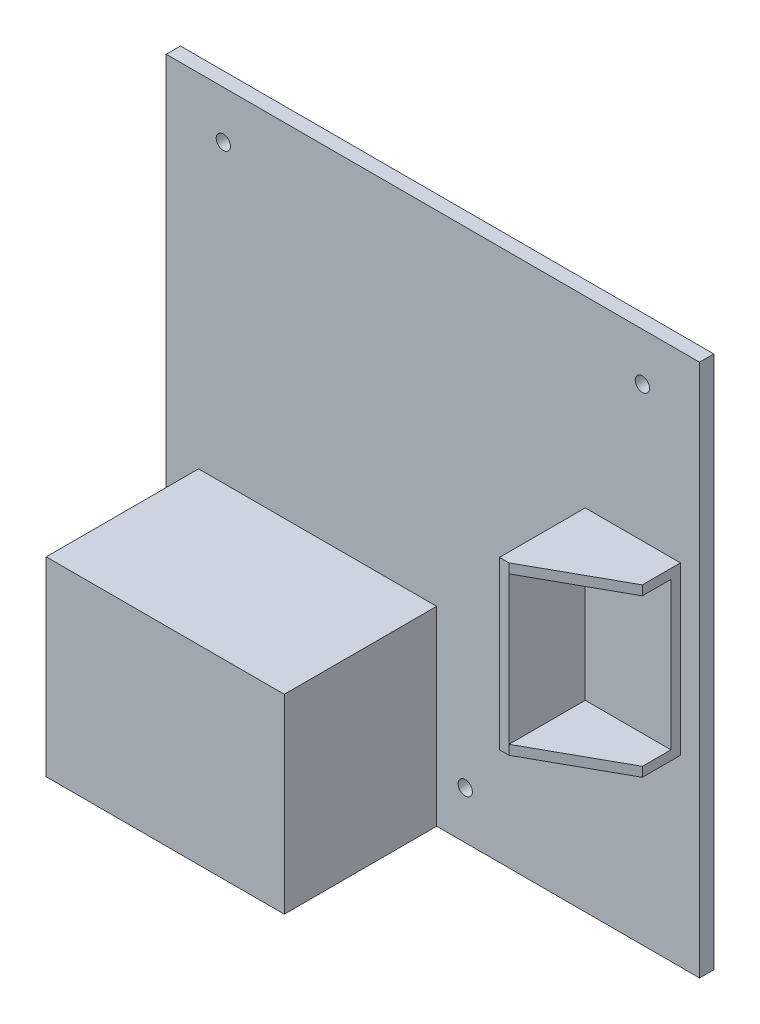
ISO-10303-21;
HEADER;
FILE_DESCRIPTION(('STEP AP214'),'2;1');
FILE_NAME('part.step','',(''),(''),'','','');
FILE_SCHEMA(('AUTOMOTIVE_DESIGN { 1 0 10303 214 1 1 1 1 }'));
ENDSEC;
DATA;
#1=APPLICATION_CONTEXT('core data for automotive mechanical design processes');
#2=APPLICATION_PROTOCOL_DEFINITION('international standard','automotive_design',2000,#1);
#3=PRODUCT_CONTEXT('',#1,'mechanical');
#4=PRODUCT('Part','Part','',(#3));
#5=PRODUCT_RELATED_PRODUCT_CATEGORY('part','',(#4));
#6=PRODUCT_DEFINITION_FORMATION('','',#4);
#7=PRODUCT_DEFINITION_CONTEXT('part definition',#1,'design');
#8=PRODUCT_DEFINITION('design','',#6,#7);
#9=PRODUCT_DEFINITION_SHAPE('','',#8);
#10=(LENGTH_UNIT() NAMED_UNIT(*) SI_UNIT(.MILLI.,.METRE.));
#11=(NAMED_UNIT(*) PLANE_ANGLE_UNIT() SI_UNIT($,.RADIAN.));
#12=(NAMED_UNIT(*) SI_UNIT($,.STERADIAN.) SOLID_ANGLE_UNIT());
#13=UNCERTAINTY_MEASURE_WITH_UNIT(LENGTH_MEASURE(1.E-05),#10,'distance_accuracy_value','');
#14=(GEOMETRIC_REPRESENTATION_CONTEXT(3) GLOBAL_UNCERTAINTY_ASSIGNED_CONTEXT((#13)) GLOBAL_UNIT_ASSIGNED_CONTEXT((#10,
#11,#12)) REPRESENTATION_CONTEXT('',''));
#15=CARTESIAN_POINT('',(0.,0.,0.));
#16=DIRECTION('',(0.,0.,1.));
#17=DIRECTION('',(1.,0.,0.));
#18=AXIS2_PLACEMENT_3D('',#15,#16,#17);
#19=CARTESIAN_POINT('',(0.,0.,3.));
#20=DIRECTION('',(0.,0.,-1.));
#21=DIRECTION('',(-1.,0.,0.));
#22=AXIS2_PLACEMENT_3D('',#19,#20,#21);
#23=PLANE('',#22);
#24=DIRECTION('',(0.,-1.,0.));
#25=VECTOR('',#24,1.);
#26=CARTESIAN_POINT('',(-49.1967650273224,-56.,3.));
#27=LINE('',#26,#25);
#28=CARTESIAN_POINT('',(-49.1967650273224,-16.,3.));
#29=VERTEX_POINT('',#28);
#30=CARTESIAN_POINT('',(-49.1967650273224,-56.,3.));
#31=VERTEX_POINT('',#30);
#32=EDGE_CURVE('E184',#29,#31,#27,.T.);
#33=ORIENTED_EDGE('',*,*,#32,.F.);
#34=DIRECTION('',(-1.,0.,0.));
#35=VECTOR('',#34,1.);
#36=CARTESIAN_POINT('',(-49.1967650273224,-16.,3.));
#37=LINE('',#36,#35);
#38=CARTESIAN_POINT('',(0.803234972677577,-16.,3.));
#39=VERTEX_POINT('',#38);
#40=EDGE_CURVE('E200',#39,#29,#37,.T.);
#41=ORIENTED_EDGE('',*,*,#40,.F.);
#42=DIRECTION('',(0.,1.,0.));
#43=VECTOR('',#42,1.);
#44=CARTESIAN_POINT('',(0.803234972677577,-56.,3.));
#45=LINE('',#44,#43);
#46=CARTESIAN_POINT('',(0.803234972677577,-56.,3.));
#47=VERTEX_POINT('',#46);
#48=EDGE_CURVE('E209',#47,#39,#45,.T.);
#49=ORIENTED_EDGE('',*,*,#48,.F.);
#50=DIRECTION('',(1.,0.,0.));
#51=VECTOR('',#50,1.);
#52=CARTESIAN_POINT('',(-56.,-56.,3.));
#53=LINE('',#52,#51);
#54=CARTESIAN_POINT('',(56.,-56.,3.));
#55=VERTEX_POINT('',#54);
#56=EDGE_CURVE('E234',#47,#55,#53,.T.);
#57=ORIENTED_EDGE('',*,*,#56,.T.);
#58=DIRECTION('',(0.,1.,0.));
#59=VECTOR('',#58,1.);
#60=CARTESIAN_POINT('',(56.,-56.,3.));
#61=LINE('',#60,#59);
#62=CARTESIAN_POINT('',(56.,56.,3.));
#63=VERTEX_POINT('',#62);
#64=EDGE_CURVE('E226',#55,#63,#61,.T.);
#65=ORIENTED_EDGE('',*,*,#64,.T.);
#66=DIRECTION('',(-1.,0.,0.));
#67=VECTOR('',#66,1.);
#68=CARTESIAN_POINT('',(-56.,56.,3.));
#69=LINE('',#68,#67);
#70=CARTESIAN_POINT('',(-56.,56.,3.));
#71=VERTEX_POINT('',#70);
#72=EDGE_CURVE('E229',#63,#71,#69,.T.);
#73=ORIENTED_EDGE('',*,*,#72,.T.);
#74=DIRECTION('',(0.,-1.,0.));
#75=VECTOR('',#74,1.);
#76=CARTESIAN_POINT('',(-56.,-56.,3.));
#77=LINE('',#76,#75);
#78=CARTESIAN_POINT('',(-56.,-56.,3.));
#79=VERTEX_POINT('',#78);
#80=EDGE_CURVE('E232',#71,#79,#77,.T.);
#81=ORIENTED_EDGE('',*,*,#80,.T.);
#82=EDGE_CURVE('E235',#79,#31,#53,.T.);
#83=ORIENTED_EDGE('',*,*,#82,.T.);
#84=EDGE_LOOP('',(#33,#41,#49,#57,#65,#73,#81,#83));
#85=FACE_BOUND('',#84,.T.);
#86=CARTESIAN_POINT('',(6.80323497267758,-46.,3.));
#87=DIRECTION('',(0.,0.,1.));
#88=DIRECTION('',(1.,0.,0.));
#89=AXIS2_PLACEMENT_3D('',#86,#87,#88);
#90=CIRCLE('',#89,1.5);
#91=CARTESIAN_POINT('',(8.30323497267758,-46.,3.));
#92=VERTEX_POINT('',#91);
#93=EDGE_CURVE('E174',#92,#92,#90,.T.);
#94=ORIENTED_EDGE('',*,*,#93,.F.);
#95=EDGE_LOOP('',(#94));
#96=FACE_BOUND('',#95,.T.);
#97=CARTESIAN_POINT('',(44.,46.,3.));
#98=DIRECTION('',(0.,0.,1.));
#99=DIRECTION('',(1.,0.,0.));
#100=AXIS2_PLACEMENT_3D('',#97,#98,#99);
#101=CIRCLE('',#100,1.5);
#102=CARTESIAN_POINT('',(45.5,46.,3.));
#103=VERTEX_POINT('',#102);
#104=EDGE_CURVE('E188',#103,#103,#101,.T.);
#105=ORIENTED_EDGE('',*,*,#104,.F.);
#106=EDGE_LOOP('',(#105));
#107=FACE_BOUND('',#106,.T.);
#108=CARTESIAN_POINT('',(-44.,46.,3.));
#109=DIRECTION('',(0.,0.,1.));
#110=DIRECTION('',(1.,0.,0.));
#111=AXIS2_PLACEMENT_3D('',#108,#109,#110);
#112=CIRCLE('',#111,1.5);
#113=CARTESIAN_POINT('',(-42.5,46.,3.));
#114=VERTEX_POINT('',#113);
#115=EDGE_CURVE('E181',#114,#114,#112,.T.);
#116=ORIENTED_EDGE('',*,*,#115,.F.);
#117=EDGE_LOOP('',(#116));
#118=FACE_BOUND('',#117,.T.);
#119=DIRECTION('',(0.,1.,0.));
#120=VECTOR('',#119,1.);
#121=CARTESIAN_POINT('',(52.,-17.5,3.));
#122=LINE('',#121,#120);
#123=CARTESIAN_POINT('',(52.,-17.5,3.));
#124=VERTEX_POINT('',#123);
#125=CARTESIAN_POINT('',(52.,17.5,3.));
#126=VERTEX_POINT('',#125);
#127=EDGE_CURVE('E169',#124,#126,#122,.T.);
#128=ORIENTED_EDGE('',*,*,#127,.F.);
#129=DIRECTION('',(1.,0.,0.));
#130=VECTOR('',#129,1.);
#131=CARTESIAN_POINT('',(32.,-17.5,3.));
#132=LINE('',#131,#130);
#133=CARTESIAN_POINT('',(32.,-17.5,3.));
#134=VERTEX_POINT('',#133);
#135=EDGE_CURVE('E522',#134,#124,#132,.T.);
#136=ORIENTED_EDGE('',*,*,#135,.F.);
#137=DIRECTION('',(0.,-1.,0.));
#138=VECTOR('',#137,1.);
#139=CARTESIAN_POINT('',(32.,-17.5,3.));
#140=LINE('',#139,#138);
#141=CARTESIAN_POINT('',(32.,17.5,3.));
#142=VERTEX_POINT('',#141);
#143=EDGE_CURVE('E531',#142,#134,#140,.T.);
#144=ORIENTED_EDGE('',*,*,#143,.F.);
#145=DIRECTION('',(-1.,0.,0.));
#146=VECTOR('',#145,1.);
#147=CARTESIAN_POINT('',(32.,17.5,3.));
#148=LINE('',#147,#146);
#149=EDGE_CURVE('E529',#126,#142,#148,.T.);
#150=ORIENTED_EDGE('',*,*,#149,.F.);
#151=EDGE_LOOP('',(#128,#136,#144,#150));
#152=FACE_BOUND('',#151,.T.);
#153=ADVANCED_FACE('F32',(#85,#96,#107,#118,#152),#23,.F.);
#154=CARTESIAN_POINT('',(56.,-56.,3.));
#155=DIRECTION('',(-1.,0.,0.));
#156=DIRECTION('',(0.,0.,1.));
#157=AXIS2_PLACEMENT_3D('',#154,#155,#156);
#158=PLANE('',#157);
#159=DIRECTION('',(0.,1.,0.));
#160=VECTOR('',#159,1.);
#161=CARTESIAN_POINT('',(56.,-56.,0.));
#162=LINE('',#161,#160);
#163=CARTESIAN_POINT('',(56.,-56.,0.));
#164=VERTEX_POINT('',#163);
#165=CARTESIAN_POINT('',(56.,56.,0.));
#166=VERTEX_POINT('',#165);
#167=EDGE_CURVE('E225',#164,#166,#162,.T.);
#168=ORIENTED_EDGE('',*,*,#167,.T.);
#169=DIRECTION('',(0.,0.,-1.));
#170=VECTOR('',#169,1.);
#171=CARTESIAN_POINT('',(56.,56.,3.));
#172=LINE('',#171,#170);
#173=EDGE_CURVE('E40',#63,#166,#172,.T.);
#174=ORIENTED_EDGE('',*,*,#173,.F.);
#175=ORIENTED_EDGE('',*,*,#64,.F.);
#176=DIRECTION('',(0.,0.,-1.));
#177=VECTOR('',#176,1.);
#178=CARTESIAN_POINT('',(56.,-56.,3.));
#179=LINE('',#178,#177);
#180=EDGE_CURVE('E237',#55,#164,#179,.T.);
#181=ORIENTED_EDGE('',*,*,#180,.T.);
#182=EDGE_LOOP('',(#168,#174,#175,#181));
#183=FACE_BOUND('',#182,.T.);
#184=ADVANCED_FACE('F34',(#183),#158,.F.);
#185=CARTESIAN_POINT('',(-56.,56.,3.));
#186=DIRECTION('',(0.,-1.,0.));
#187=DIRECTION('',(0.,0.,-1.));
#188=AXIS2_PLACEMENT_3D('',#185,#186,#187);
#189=PLANE('',#188);
#190=DIRECTION('',(-1.,0.,0.));
#191=VECTOR('',#190,1.);
#192=CARTESIAN_POINT('',(-56.,56.,0.));
#193=LINE('',#192,#191);
#194=CARTESIAN_POINT('',(-56.,56.,0.));
#195=VERTEX_POINT('',#194);
#196=EDGE_CURVE('E240',#166,#195,#193,.T.);
#197=ORIENTED_EDGE('',*,*,#196,.T.);
#198=DIRECTION('',(0.,0.,-1.));
#199=VECTOR('',#198,1.);
#200=CARTESIAN_POINT('',(-56.,56.,3.));
#201=LINE('',#200,#199);
#202=EDGE_CURVE('E250',#71,#195,#201,.T.);
#203=ORIENTED_EDGE('',*,*,#202,.F.);
#204=ORIENTED_EDGE('',*,*,#72,.F.);
#205=ORIENTED_EDGE('',*,*,#173,.T.);
#206=EDGE_LOOP('',(#197,#203,#204,#205));
#207=FACE_BOUND('',#206,.T.);
#208=ADVANCED_FACE('F255',(#207),#189,.F.);
#209=CARTESIAN_POINT('',(-56.,-56.,3.));
#210=DIRECTION('',(1.,0.,0.));
#211=DIRECTION('',(0.,0.,-1.));
#212=AXIS2_PLACEMENT_3D('',#209,#210,#211);
#213=PLANE('',#212);
#214=DIRECTION('',(0.,-1.,0.));
#215=VECTOR('',#214,1.);
#216=CARTESIAN_POINT('',(-56.,-56.,0.));
#217=LINE('',#216,#215);
#218=CARTESIAN_POINT('',(-56.,-56.,0.));
#219=VERTEX_POINT('',#218);
#220=EDGE_CURVE('E242',#195,#219,#217,.T.);
#221=ORIENTED_EDGE('',*,*,#220,.T.);
#222=DIRECTION('',(0.,0.,-1.));
#223=VECTOR('',#222,1.);
#224=CARTESIAN_POINT('',(-56.,-56.,3.));
#225=LINE('',#224,#223);
#226=EDGE_CURVE('E247',#79,#219,#225,.T.);
#227=ORIENTED_EDGE('',*,*,#226,.F.);
#228=ORIENTED_EDGE('',*,*,#80,.F.);
#229=ORIENTED_EDGE('',*,*,#202,.T.);
#230=EDGE_LOOP('',(#221,#227,#228,#229));
#231=FACE_BOUND('',#230,.T.);
#232=ADVANCED_FACE('F267',(#231),#213,.F.);
#233=CARTESIAN_POINT('',(-56.,-56.,3.));
#234=DIRECTION('',(0.,1.,0.));
#235=DIRECTION('',(-1.,0.,0.));
#236=AXIS2_PLACEMENT_3D('',#233,#234,#235);
#237=PLANE('',#236);
#238=DIRECTION('',(1.,0.,0.));
#239=VECTOR('',#238,1.);
#240=CARTESIAN_POINT('',(-56.,-56.,0.));
#241=LINE('',#240,#239);
#242=EDGE_CURVE('E230',#219,#164,#241,.T.);
#243=ORIENTED_EDGE('',*,*,#242,.T.);
#244=ORIENTED_EDGE('',*,*,#180,.F.);
#245=ORIENTED_EDGE('',*,*,#56,.F.);
#246=DIRECTION('',(0.,0.,-1.));
#247=VECTOR('',#246,1.);
#248=CARTESIAN_POINT('',(0.803234972677577,-56.,35.));
#249=LINE('',#248,#247);
#250=CARTESIAN_POINT('',(0.803234972677577,-56.,35.));
#251=VERTEX_POINT('',#250);
#252=EDGE_CURVE('E219',#251,#47,#249,.T.);
#253=ORIENTED_EDGE('',*,*,#252,.F.);
#254=DIRECTION('',(1.,0.,0.));
#255=VECTOR('',#254,1.);
#256=CARTESIAN_POINT('',(-49.1967650273224,-56.,35.));
#257=LINE('',#256,#255);
#258=CARTESIAN_POINT('',(-49.1967650273224,-56.,35.));
#259=VERTEX_POINT('',#258);
#260=EDGE_CURVE('E199',#259,#251,#257,.T.);
#261=ORIENTED_EDGE('',*,*,#260,.F.);
#262=DIRECTION('',(0.,0.,-1.));
#263=VECTOR('',#262,1.);
#264=CARTESIAN_POINT('',(-49.1967650273224,-56.,35.));
#265=LINE('',#264,#263);
#266=EDGE_CURVE('E222',#259,#31,#265,.T.);
#267=ORIENTED_EDGE('',*,*,#266,.T.);
#268=ORIENTED_EDGE('',*,*,#82,.F.);
#269=ORIENTED_EDGE('',*,*,#226,.T.);
#270=EDGE_LOOP('',(#243,#244,#245,#253,#261,#267,#268,#269));
#271=FACE_BOUND('',#270,.T.);
#272=ADVANCED_FACE('F271',(#271),#237,.F.);
#273=CARTESIAN_POINT('',(0.,0.,0.));
#274=DIRECTION('',(0.,0.,-1.));
#275=DIRECTION('',(-1.,0.,0.));
#276=AXIS2_PLACEMENT_3D('',#273,#274,#275);
#277=PLANE('',#276);
#278=CARTESIAN_POINT('',(-44.,46.,0.));
#279=DIRECTION('',(0.,0.,-1.));
#280=DIRECTION('',(-1.,0.,0.));
#281=AXIS2_PLACEMENT_3D('',#278,#279,#280);
#282=CIRCLE('',#281,1.5);
#283=CARTESIAN_POINT('',(-45.5,46.,0.));
#284=VERTEX_POINT('',#283);
#285=EDGE_CURVE('E185',#284,#284,#282,.F.);
#286=ORIENTED_EDGE('',*,*,#285,.T.);
#287=EDGE_LOOP('',(#286));
#288=FACE_BOUND('',#287,.T.);
#289=CARTESIAN_POINT('',(44.,46.,0.));
#290=DIRECTION('',(0.,0.,-1.));
#291=DIRECTION('',(-1.,0.,0.));
#292=AXIS2_PLACEMENT_3D('',#289,#290,#291);
#293=CIRCLE('',#292,1.5);
#294=CARTESIAN_POINT('',(42.5,46.,0.));
#295=VERTEX_POINT('',#294);
#296=EDGE_CURVE('E191',#295,#295,#293,.F.);
#297=ORIENTED_EDGE('',*,*,#296,.T.);
#298=EDGE_LOOP('',(#297));
#299=FACE_BOUND('',#298,.T.);
#300=CARTESIAN_POINT('',(6.80323497267758,-46.,0.));
#301=DIRECTION('',(0.,0.,-1.));
#302=DIRECTION('',(-1.,0.,0.));
#303=AXIS2_PLACEMENT_3D('',#300,#301,#302);
#304=CIRCLE('',#303,1.5);
#305=CARTESIAN_POINT('',(5.30323497267758,-46.,0.));
#306=VERTEX_POINT('',#305);
#307=EDGE_CURVE('E170',#306,#306,#304,.F.);
#308=ORIENTED_EDGE('',*,*,#307,.T.);
#309=EDGE_LOOP('',(#308));
#310=FACE_BOUND('',#309,.T.);
#311=ORIENTED_EDGE('',*,*,#167,.F.);
#312=ORIENTED_EDGE('',*,*,#242,.F.);
#313=ORIENTED_EDGE('',*,*,#220,.F.);
#314=ORIENTED_EDGE('',*,*,#196,.F.);
#315=EDGE_LOOP('',(#311,#312,#313,#314));
#316=FACE_BOUND('',#315,.T.);
#317=ADVANCED_FACE('F263',(#288,#299,#310,#316),#277,.T.);
#318=CARTESIAN_POINT('',(-49.1967650273224,-56.,35.));
#319=DIRECTION('',(1.,0.,0.));
#320=DIRECTION('',(0.,0.,-1.));
#321=AXIS2_PLACEMENT_3D('',#318,#319,#320);
#322=PLANE('',#321);
#323=ORIENTED_EDGE('',*,*,#32,.T.);
#324=ORIENTED_EDGE('',*,*,#266,.F.);
#325=DIRECTION('',(0.,-1.,0.));
#326=VECTOR('',#325,1.);
#327=CARTESIAN_POINT('',(-49.1967650273224,-56.,35.));
#328=LINE('',#327,#326);
#329=CARTESIAN_POINT('',(-49.1967650273224,-16.,35.));
#330=VERTEX_POINT('',#329);
#331=EDGE_CURVE('E196',#330,#259,#328,.T.);
#332=ORIENTED_EDGE('',*,*,#331,.F.);
#333=DIRECTION('',(0.,0.,-1.));
#334=VECTOR('',#333,1.);
#335=CARTESIAN_POINT('',(-49.1967650273224,-16.,35.));
#336=LINE('',#335,#334);
#337=EDGE_CURVE('E206',#330,#29,#336,.T.);
#338=ORIENTED_EDGE('',*,*,#337,.T.);
#339=EDGE_LOOP('',(#323,#324,#332,#338));
#340=FACE_BOUND('',#339,.T.);
#341=ADVANCED_FACE('F287',(#340),#322,.F.);
#342=CARTESIAN_POINT('',(0.803234972677577,-56.,35.));
#343=DIRECTION('',(-1.,0.,0.));
#344=DIRECTION('',(0.,0.,1.));
#345=AXIS2_PLACEMENT_3D('',#342,#343,#344);
#346=PLANE('',#345);
#347=ORIENTED_EDGE('',*,*,#48,.T.);
#348=DIRECTION('',(0.,0.,-1.));
#349=VECTOR('',#348,1.);
#350=CARTESIAN_POINT('',(0.803234972677577,-16.,35.));
#351=LINE('',#350,#349);
#352=CARTESIAN_POINT('',(0.803234972677577,-16.,35.));
#353=VERTEX_POINT('',#352);
#354=EDGE_CURVE('E216',#353,#39,#351,.T.);
#355=ORIENTED_EDGE('',*,*,#354,.F.);
#356=DIRECTION('',(0.,1.,0.));
#357=VECTOR('',#356,1.);
#358=CARTESIAN_POINT('',(0.803234972677577,-56.,35.));
#359=LINE('',#358,#357);
#360=EDGE_CURVE('E202',#251,#353,#359,.T.);
#361=ORIENTED_EDGE('',*,*,#360,.F.);
#362=ORIENTED_EDGE('',*,*,#252,.T.);
#363=EDGE_LOOP('',(#347,#355,#361,#362));
#364=FACE_BOUND('',#363,.T.);
#365=ADVANCED_FACE('F279',(#364),#346,.F.);
#366=CARTESIAN_POINT('',(-49.1967650273224,-16.,35.));
#367=DIRECTION('',(0.,-1.,0.));
#368=DIRECTION('',(0.,0.,-1.));
#369=AXIS2_PLACEMENT_3D('',#366,#367,#368);
#370=PLANE('',#369);
#371=ORIENTED_EDGE('',*,*,#40,.T.);
#372=ORIENTED_EDGE('',*,*,#337,.F.);
#373=DIRECTION('',(-1.,0.,0.));
#374=VECTOR('',#373,1.);
#375=CARTESIAN_POINT('',(-49.1967650273224,-16.,35.));
#376=LINE('',#375,#374);
#377=EDGE_CURVE('E204',#353,#330,#376,.T.);
#378=ORIENTED_EDGE('',*,*,#377,.F.);
#379=ORIENTED_EDGE('',*,*,#354,.T.);
#380=EDGE_LOOP('',(#371,#372,#378,#379));
#381=FACE_BOUND('',#380,.T.);
#382=ADVANCED_FACE('F289',(#381),#370,.F.);
#383=CARTESIAN_POINT('',(0.,0.,35.));
#384=DIRECTION('',(0.,0.,-1.));
#385=DIRECTION('',(-1.,0.,0.));
#386=AXIS2_PLACEMENT_3D('',#383,#384,#385);
#387=PLANE('',#386);
#388=ORIENTED_EDGE('',*,*,#331,.T.);
#389=ORIENTED_EDGE('',*,*,#260,.T.);
#390=ORIENTED_EDGE('',*,*,#360,.T.);
#391=ORIENTED_EDGE('',*,*,#377,.T.);
#392=EDGE_LOOP('',(#388,#389,#390,#391));
#393=FACE_BOUND('',#392,.T.);
#394=ADVANCED_FACE('F283',(#393),#387,.F.);
#395=CARTESIAN_POINT('',(6.80323497267758,-46.,-0.00100000000000013));
#396=DIRECTION('',(0.,0.,1.));
#397=DIRECTION('',(1.,0.,0.));
#398=AXIS2_PLACEMENT_3D('',#395,#396,#397);
#399=CYLINDRICAL_SURFACE('',#398,1.5);
#400=ORIENTED_EDGE('',*,*,#307,.F.);
#401=EDGE_LOOP('',(#400));
#402=FACE_BOUND('',#401,.T.);
#403=ORIENTED_EDGE('',*,*,#93,.T.);
#404=EDGE_LOOP('',(#403));
#405=FACE_BOUND('',#404,.T.);
#406=ADVANCED_FACE('F296',(#402,#405),#399,.F.);
#407=CARTESIAN_POINT('',(44.,46.,-0.00100000000000013));
#408=DIRECTION('',(0.,0.,1.));
#409=DIRECTION('',(1.,0.,0.));
#410=AXIS2_PLACEMENT_3D('',#407,#408,#409);
#411=CYLINDRICAL_SURFACE('',#410,1.5);
#412=ORIENTED_EDGE('',*,*,#296,.F.);
#413=EDGE_LOOP('',(#412));
#414=FACE_BOUND('',#413,.T.);
#415=ORIENTED_EDGE('',*,*,#104,.T.);
#416=EDGE_LOOP('',(#415));
#417=FACE_BOUND('',#416,.T.);
#418=ADVANCED_FACE('F357',(#414,#417),#411,.F.);
#419=CARTESIAN_POINT('',(-44.,46.,-0.00100000000000013));
#420=DIRECTION('',(0.,0.,1.));
#421=DIRECTION('',(1.,0.,0.));
#422=AXIS2_PLACEMENT_3D('',#419,#420,#421);
#423=CYLINDRICAL_SURFACE('',#422,1.5);
#424=ORIENTED_EDGE('',*,*,#285,.F.);
#425=EDGE_LOOP('',(#424));
#426=FACE_BOUND('',#425,.T.);
#427=ORIENTED_EDGE('',*,*,#115,.T.);
#428=EDGE_LOOP('',(#427));
#429=FACE_BOUND('',#428,.T.);
#430=ADVANCED_FACE('F364',(#426,#429),#423,.F.);
#431=CARTESIAN_POINT('',(52.,-17.5,21.));
#432=DIRECTION('',(-1.,0.,0.));
#433=DIRECTION('',(0.,0.,1.));
#434=AXIS2_PLACEMENT_3D('',#431,#432,#433);
#435=PLANE('',#434);
#436=DIRECTION('',(0.,0.,-1.));
#437=VECTOR('',#436,1.);
#438=CARTESIAN_POINT('',(52.,17.5,21.));
#439=LINE('',#438,#437);
#440=CARTESIAN_POINT('',(52.,17.5,11.));
#441=VERTEX_POINT('',#440);
#442=EDGE_CURVE('E54',#441,#126,#439,.T.);
#443=ORIENTED_EDGE('',*,*,#442,.F.);
#444=DIRECTION('',(0.,1.,0.));
#445=VECTOR('',#444,1.);
#446=CARTESIAN_POINT('',(52.,-56.,11.));
#447=LINE('',#446,#445);
#448=CARTESIAN_POINT('',(52.,15.5,11.));
#449=VERTEX_POINT('',#448);
#450=EDGE_CURVE('E151',#449,#441,#447,.T.);
#451=ORIENTED_EDGE('',*,*,#450,.F.);
#452=DIRECTION('',(0.,0.,1.));
#453=VECTOR('',#452,1.);
#454=CARTESIAN_POINT('',(52.,15.5,5.));
#455=LINE('',#454,#453);
#456=CARTESIAN_POINT('',(52.,15.5,5.));
#457=VERTEX_POINT('',#456);
#458=EDGE_CURVE('E513',#457,#449,#455,.T.);
#459=ORIENTED_EDGE('',*,*,#458,.F.);
#460=DIRECTION('',(0.,1.,0.));
#461=VECTOR('',#460,1.);
#462=CARTESIAN_POINT('',(52.,0.,5.));
#463=LINE('',#462,#461);
#464=CARTESIAN_POINT('',(52.,-15.5,5.));
#465=VERTEX_POINT('',#464);
#466=EDGE_CURVE('E500',#465,#457,#463,.T.);
#467=ORIENTED_EDGE('',*,*,#466,.F.);
#468=DIRECTION('',(0.,0.,1.));
#469=VECTOR('',#468,1.);
#470=CARTESIAN_POINT('',(52.,-15.5,5.));
#471=LINE('',#470,#469);
#472=CARTESIAN_POINT('',(52.,-15.5,11.));
#473=VERTEX_POINT('',#472);
#474=EDGE_CURVE('E515',#465,#473,#471,.T.);
#475=ORIENTED_EDGE('',*,*,#474,.T.);
#476=CARTESIAN_POINT('',(52.,-17.5,11.));
#477=VERTEX_POINT('',#476);
#478=EDGE_CURVE('E47',#477,#473,#447,.T.);
#479=ORIENTED_EDGE('',*,*,#478,.F.);
#480=DIRECTION('',(0.,0.,-1.));
#481=VECTOR('',#480,1.);
#482=CARTESIAN_POINT('',(52.,-17.5,21.));
#483=LINE('',#482,#481);
#484=EDGE_CURVE('E527',#477,#124,#483,.T.);
#485=ORIENTED_EDGE('',*,*,#484,.T.);
#486=ORIENTED_EDGE('',*,*,#127,.T.);
#487=EDGE_LOOP('',(#443,#451,#459,#467,#475,#479,#485,#486));
#488=FACE_BOUND('',#487,.T.);
#489=ADVANCED_FACE('F167',(#488),#435,.F.);
#490=CARTESIAN_POINT('',(32.,17.5,21.));
#491=DIRECTION('',(0.,-1.,0.));
#492=DIRECTION('',(0.,0.,-1.));
#493=AXIS2_PLACEMENT_3D('',#490,#491,#492);
#494=PLANE('',#493);
#495=DIRECTION('',(-1.,0.,0.));
#496=VECTOR('',#495,1.);
#497=CARTESIAN_POINT('',(32.,17.5,21.));
#498=LINE('',#497,#496);
#499=CARTESIAN_POINT('',(34.,17.5,21.));
#500=VERTEX_POINT('',#499);
#501=CARTESIAN_POINT('',(32.,17.5,21.));
#502=VERTEX_POINT('',#501);
#503=EDGE_CURVE('E164',#500,#502,#498,.T.);
#504=ORIENTED_EDGE('',*,*,#503,.F.);
#505=DIRECTION('',(-0.874157276121538,0.,0.485642931178632));
#506=VECTOR('',#505,1.);
#507=CARTESIAN_POINT('',(34.,17.5,21.));
#508=LINE('',#507,#506);
#509=EDGE_CURVE('E153',#441,#500,#508,.T.);
#510=ORIENTED_EDGE('',*,*,#509,.F.);
#511=ORIENTED_EDGE('',*,*,#442,.T.);
#512=ORIENTED_EDGE('',*,*,#149,.T.);
#513=DIRECTION('',(0.,0.,-1.));
#514=VECTOR('',#513,1.);
#515=CARTESIAN_POINT('',(32.,17.5,21.));
#516=LINE('',#515,#514);
#517=EDGE_CURVE('E171',#502,#142,#516,.T.);
#518=ORIENTED_EDGE('',*,*,#517,.F.);
#519=EDGE_LOOP('',(#504,#510,#511,#512,#518));
#520=FACE_BOUND('',#519,.T.);
#521=ADVANCED_FACE('F162',(#520),#494,.F.);
#522=CARTESIAN_POINT('',(32.,-17.5,21.));
#523=DIRECTION('',(1.,0.,0.));
#524=DIRECTION('',(0.,0.,-1.));
#525=AXIS2_PLACEMENT_3D('',#522,#523,#524);
#526=PLANE('',#525);
#527=ORIENTED_EDGE('',*,*,#143,.T.);
#528=DIRECTION('',(0.,0.,-1.));
#529=VECTOR('',#528,1.);
#530=CARTESIAN_POINT('',(32.,-17.5,21.));
#531=LINE('',#530,#529);
#532=CARTESIAN_POINT('',(32.,-17.5,21.));
#533=VERTEX_POINT('',#532);
#534=EDGE_CURVE('E177',#533,#134,#531,.T.);
#535=ORIENTED_EDGE('',*,*,#534,.F.);
#536=DIRECTION('',(0.,-1.,0.));
#537=VECTOR('',#536,1.);
#538=CARTESIAN_POINT('',(32.,-17.5,21.));
#539=LINE('',#538,#537);
#540=EDGE_CURVE('E521',#502,#533,#539,.T.);
#541=ORIENTED_EDGE('',*,*,#540,.F.);
#542=ORIENTED_EDGE('',*,*,#517,.T.);
#543=EDGE_LOOP('',(#527,#535,#541,#542));
#544=FACE_BOUND('',#543,.T.);
#545=ADVANCED_FACE('F386',(#544),#526,.F.);
#546=CARTESIAN_POINT('',(32.,-17.5,21.));
#547=DIRECTION('',(0.,1.,0.));
#548=DIRECTION('',(0.,0.,1.));
#549=AXIS2_PLACEMENT_3D('',#546,#547,#548);
#550=PLANE('',#549);
#551=ORIENTED_EDGE('',*,*,#484,.F.);
#552=DIRECTION('',(-0.874157276121538,0.,0.485642931178632));
#553=VECTOR('',#552,1.);
#554=CARTESIAN_POINT('',(32.4716981132075,-17.5,21.8490566037736));
#555=LINE('',#554,#553);
#556=CARTESIAN_POINT('',(34.,-17.5,21.));
#557=VERTEX_POINT('',#556);
#558=EDGE_CURVE('E503',#477,#557,#555,.T.);
#559=ORIENTED_EDGE('',*,*,#558,.T.);
#560=DIRECTION('',(1.,0.,0.));
#561=VECTOR('',#560,1.);
#562=CARTESIAN_POINT('',(32.,-17.5,21.));
#563=LINE('',#562,#561);
#564=EDGE_CURVE('E524',#533,#557,#563,.T.);
#565=ORIENTED_EDGE('',*,*,#564,.F.);
#566=ORIENTED_EDGE('',*,*,#534,.T.);
#567=ORIENTED_EDGE('',*,*,#135,.T.);
#568=EDGE_LOOP('',(#551,#559,#565,#566,#567));
#569=FACE_BOUND('',#568,.T.);
#570=ADVANCED_FACE('F394',(#569),#550,.F.);
#571=CARTESIAN_POINT('',(0.,0.,21.));
#572=DIRECTION('',(0.,0.,-1.));
#573=DIRECTION('',(-1.,0.,0.));
#574=AXIS2_PLACEMENT_3D('',#571,#572,#573);
#575=PLANE('',#574);
#576=ORIENTED_EDGE('',*,*,#564,.T.);
#577=DIRECTION('',(0.,1.,0.));
#578=VECTOR('',#577,1.);
#579=CARTESIAN_POINT('',(34.,-56.,21.));
#580=LINE('',#579,#578);
#581=CARTESIAN_POINT('',(34.,-15.5,21.));
#582=VERTEX_POINT('',#581);
#583=EDGE_CURVE('E546',#557,#582,#580,.T.);
#584=ORIENTED_EDGE('',*,*,#583,.T.);
#585=DIRECTION('',(0.,-1.,0.));
#586=VECTOR('',#585,1.);
#587=CARTESIAN_POINT('',(34.,0.,21.));
#588=LINE('',#587,#586);
#589=CARTESIAN_POINT('',(34.,15.5,21.));
#590=VERTEX_POINT('',#589);
#591=EDGE_CURVE('E498',#590,#582,#588,.T.);
#592=ORIENTED_EDGE('',*,*,#591,.F.);
#593=EDGE_CURVE('E545',#590,#500,#580,.T.);
#594=ORIENTED_EDGE('',*,*,#593,.T.);
#595=ORIENTED_EDGE('',*,*,#503,.T.);
#596=ORIENTED_EDGE('',*,*,#540,.T.);
#597=EDGE_LOOP('',(#576,#584,#592,#594,#595,#596));
#598=FACE_BOUND('',#597,.T.);
#599=ADVANCED_FACE('F401',(#598),#575,.F.);
#600=CARTESIAN_POINT('',(34.,0.,5.));
#601=DIRECTION('',(-1.,0.,0.));
#602=DIRECTION('',(0.,-1.,0.));
#603=AXIS2_PLACEMENT_3D('',#600,#601,#602);
#604=PLANE('',#603);
#605=ORIENTED_EDGE('',*,*,#591,.T.);
#606=DIRECTION('',(0.,0.,1.));
#607=VECTOR('',#606,1.);
#608=CARTESIAN_POINT('',(34.,-15.5,5.));
#609=LINE('',#608,#607);
#610=CARTESIAN_POINT('',(34.,-15.5,5.));
#611=VERTEX_POINT('',#610);
#612=EDGE_CURVE('E509',#611,#582,#609,.T.);
#613=ORIENTED_EDGE('',*,*,#612,.F.);
#614=DIRECTION('',(0.,-1.,0.));
#615=VECTOR('',#614,1.);
#616=CARTESIAN_POINT('',(34.,0.,5.));
#617=LINE('',#616,#615);
#618=CARTESIAN_POINT('',(34.,15.5,5.));
#619=VERTEX_POINT('',#618);
#620=EDGE_CURVE('E491',#619,#611,#617,.T.);
#621=ORIENTED_EDGE('',*,*,#620,.F.);
#622=DIRECTION('',(0.,0.,1.));
#623=VECTOR('',#622,1.);
#624=CARTESIAN_POINT('',(34.,15.5,5.));
#625=LINE('',#624,#623);
#626=EDGE_CURVE('E511',#619,#590,#625,.T.);
#627=ORIENTED_EDGE('',*,*,#626,.T.);
#628=EDGE_LOOP('',(#605,#613,#621,#627));
#629=FACE_BOUND('',#628,.T.);
#630=ADVANCED_FACE('F409',(#629),#604,.F.);
#631=CARTESIAN_POINT('',(0.,15.5,5.));
#632=DIRECTION('',(0.,1.,0.));
#633=DIRECTION('',(-1.,0.,0.));
#634=AXIS2_PLACEMENT_3D('',#631,#632,#633);
#635=PLANE('',#634);
#636=ORIENTED_EDGE('',*,*,#458,.T.);
#637=DIRECTION('',(-0.874157276121538,0.,0.485642931178632));
#638=VECTOR('',#637,1.);
#639=CARTESIAN_POINT('',(14.811320754717,15.5,31.6603773584906));
#640=LINE('',#639,#638);
#641=EDGE_CURVE('E156',#449,#590,#640,.T.);
#642=ORIENTED_EDGE('',*,*,#641,.T.);
#643=ORIENTED_EDGE('',*,*,#626,.F.);
#644=DIRECTION('',(-1.,0.,0.));
#645=VECTOR('',#644,1.);
#646=CARTESIAN_POINT('',(0.,15.5,5.));
#647=LINE('',#646,#645);
#648=EDGE_CURVE('E496',#457,#619,#647,.T.);
#649=ORIENTED_EDGE('',*,*,#648,.F.);
#650=EDGE_LOOP('',(#636,#642,#643,#649));
#651=FACE_BOUND('',#650,.T.);
#652=ADVANCED_FACE('F417',(#651),#635,.F.);
#653=CARTESIAN_POINT('',(0.,-15.5,5.));
#654=DIRECTION('',(0.,-1.,0.));
#655=DIRECTION('',(1.,0.,0.));
#656=AXIS2_PLACEMENT_3D('',#653,#654,#655);
#657=PLANE('',#656);
#658=ORIENTED_EDGE('',*,*,#612,.T.);
#659=DIRECTION('',(0.874157276121538,0.,-0.485642931178632));
#660=VECTOR('',#659,1.);
#661=CARTESIAN_POINT('',(14.811320754717,-15.5,31.6603773584906));
#662=LINE('',#661,#660);
#663=EDGE_CURVE('E11',#582,#473,#662,.T.);
#664=ORIENTED_EDGE('',*,*,#663,.T.);
#665=ORIENTED_EDGE('',*,*,#474,.F.);
#666=DIRECTION('',(1.,0.,0.));
#667=VECTOR('',#666,1.);
#668=CARTESIAN_POINT('',(0.,-15.5,5.));
#669=LINE('',#668,#667);
#670=EDGE_CURVE('E493',#611,#465,#669,.T.);
#671=ORIENTED_EDGE('',*,*,#670,.F.);
#672=EDGE_LOOP('',(#658,#664,#665,#671));
#673=FACE_BOUND('',#672,.T.);
#674=ADVANCED_FACE('F425',(#673),#657,.F.);
#675=CARTESIAN_POINT('',(0.,0.,5.));
#676=DIRECTION('',(0.,0.,1.));
#677=DIRECTION('',(1.,0.,0.));
#678=AXIS2_PLACEMENT_3D('',#675,#676,#677);
#679=PLANE('',#678);
#680=ORIENTED_EDGE('',*,*,#620,.T.);
#681=ORIENTED_EDGE('',*,*,#670,.T.);
#682=ORIENTED_EDGE('',*,*,#466,.T.);
#683=ORIENTED_EDGE('',*,*,#648,.T.);
#684=EDGE_LOOP('',(#680,#681,#682,#683));
#685=FACE_BOUND('',#684,.T.);
#686=ADVANCED_FACE('F433',(#685),#679,.T.);
#687=CARTESIAN_POINT('',(34.,-56.,21.));
#688=DIRECTION('',(-0.485642931178632,0.,-0.874157276121538));
#689=DIRECTION('',(-0.874157276121538,0.,0.485642931178632));
#690=AXIS2_PLACEMENT_3D('',#687,#688,#689);
#691=PLANE('',#690);
#692=ORIENTED_EDGE('',*,*,#478,.T.);
#693=ORIENTED_EDGE('',*,*,#663,.F.);
#694=ORIENTED_EDGE('',*,*,#583,.F.);
#695=ORIENTED_EDGE('',*,*,#558,.F.);
#696=EDGE_LOOP('',(#692,#693,#694,#695));
#697=FACE_BOUND('',#696,.T.);
#698=ADVANCED_FACE('F441',(#697),#691,.F.);
#699=ORIENTED_EDGE('',*,*,#450,.T.);
#700=ORIENTED_EDGE('',*,*,#509,.T.);
#701=ORIENTED_EDGE('',*,*,#593,.F.);
#702=ORIENTED_EDGE('',*,*,#641,.F.);
#703=EDGE_LOOP('',(#699,#700,#701,#702));
#704=FACE_BOUND('',#703,.T.);
#705=ADVANCED_FACE('F152',(#704),#691,.F.);
#706=CLOSED_SHELL('',(#153,#184,#208,#232,#272,#317,#341,#365,#382,#394,#406,#418,#430,#489,
#521,#545,#570,#599,#630,#652,#674,#686,#698,#705));
#707=MANIFOLD_SOLID_BREP('B2',#706);
#708=ADVANCED_BREP_SHAPE_REPRESENTATION('',(#18,#707),#14);
#709=SHAPE_DEFINITION_REPRESENTATION(#9,#708);
ENDSEC;
END-ISO-10303-21;
